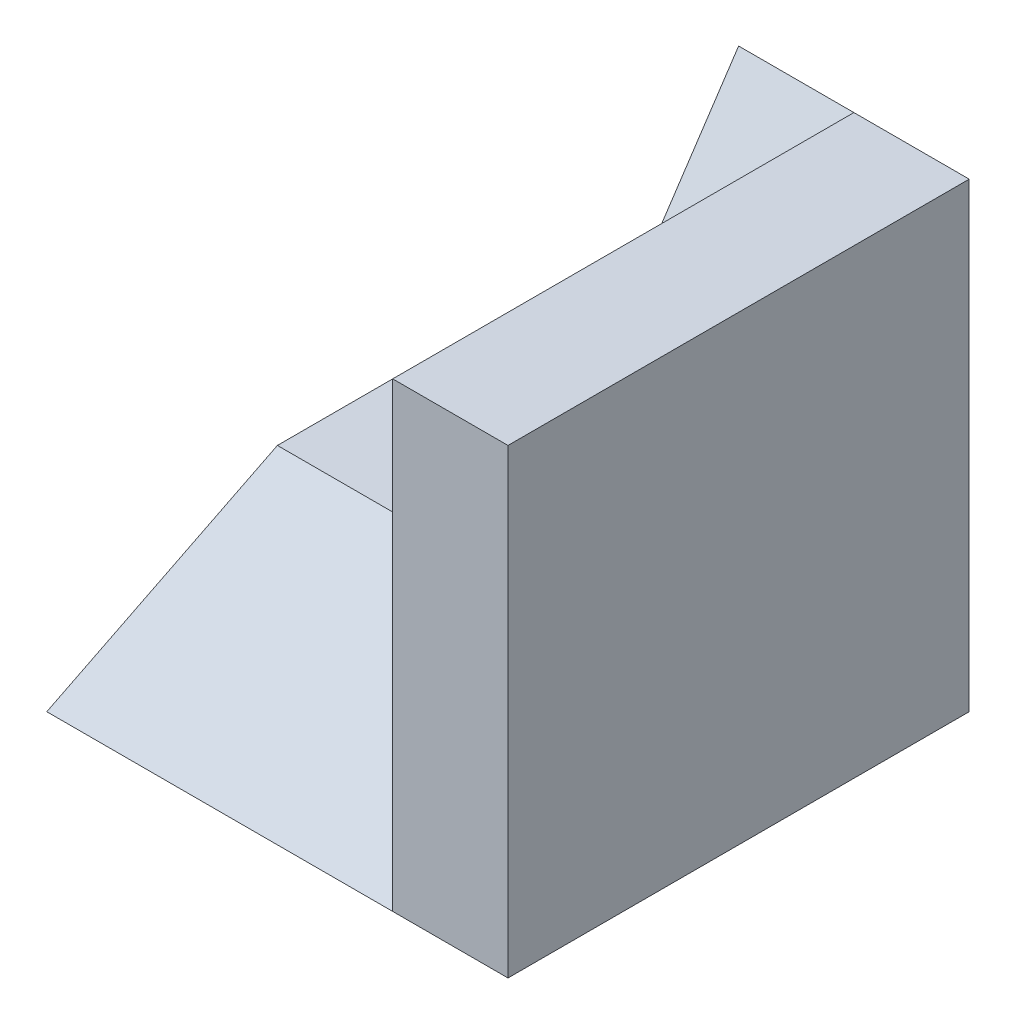
ISO-10303-21;
HEADER;
FILE_DESCRIPTION(('STEP AP214'),'2;1');
FILE_NAME('part.step','',(''),(''),'','','');
FILE_SCHEMA(('AUTOMOTIVE_DESIGN { 1 0 10303 214 1 1 1 1 }'));
ENDSEC;
DATA;
#1=APPLICATION_CONTEXT('core data for automotive mechanical design processes');
#2=APPLICATION_PROTOCOL_DEFINITION('international standard','automotive_design',2000,#1);
#3=PRODUCT_CONTEXT('',#1,'mechanical');
#4=PRODUCT('Part','Part','',(#3));
#5=PRODUCT_RELATED_PRODUCT_CATEGORY('part','',(#4));
#6=PRODUCT_DEFINITION_FORMATION('','',#4);
#7=PRODUCT_DEFINITION_CONTEXT('part definition',#1,'design');
#8=PRODUCT_DEFINITION('design','',#6,#7);
#9=PRODUCT_DEFINITION_SHAPE('','',#8);
#10=(LENGTH_UNIT() NAMED_UNIT(*) SI_UNIT(.MILLI.,.METRE.));
#11=(NAMED_UNIT(*) PLANE_ANGLE_UNIT() SI_UNIT($,.RADIAN.));
#12=(NAMED_UNIT(*) SI_UNIT($,.STERADIAN.) SOLID_ANGLE_UNIT());
#13=UNCERTAINTY_MEASURE_WITH_UNIT(LENGTH_MEASURE(1.E-05),#10,'distance_accuracy_value','');
#14=(GEOMETRIC_REPRESENTATION_CONTEXT(3) GLOBAL_UNCERTAINTY_ASSIGNED_CONTEXT((#13)) GLOBAL_UNIT_ASSIGNED_CONTEXT((#10,
#11,#12)) REPRESENTATION_CONTEXT('',''));
#15=CARTESIAN_POINT('',(0.,0.,0.));
#16=DIRECTION('',(0.,0.,1.));
#17=DIRECTION('',(1.,0.,0.));
#18=AXIS2_PLACEMENT_3D('',#15,#16,#17);
#19=CARTESIAN_POINT('',(-2.,4.,2.));
#20=DIRECTION('',(1.,0.,0.));
#21=DIRECTION('',(0.,0.,-1.));
#22=AXIS2_PLACEMENT_3D('',#19,#20,#21);
#23=PLANE('',#22);
#24=DIRECTION('',(0.,0.,1.));
#25=VECTOR('',#24,1.);
#26=CARTESIAN_POINT('',(-2.,1.,-2.));
#27=LINE('',#26,#25);
#28=CARTESIAN_POINT('',(-2.,1.,-2.));
#29=VERTEX_POINT('',#28);
#30=CARTESIAN_POINT('',(-2.,0.999999999999999,0.));
#31=VERTEX_POINT('',#30);
#32=EDGE_CURVE('E146',#29,#31,#27,.T.);
#33=ORIENTED_EDGE('',*,*,#32,.F.);
#34=DIRECTION('',(0.,-1.,0.));
#35=VECTOR('',#34,1.);
#36=CARTESIAN_POINT('',(-2.,4.,-2.));
#37=LINE('',#36,#35);
#38=CARTESIAN_POINT('',(-2.,0.,-2.));
#39=VERTEX_POINT('',#38);
#40=EDGE_CURVE('E93',#29,#39,#37,.T.);
#41=ORIENTED_EDGE('',*,*,#40,.T.);
#42=DIRECTION('',(0.,0.,1.));
#43=VECTOR('',#42,1.);
#44=CARTESIAN_POINT('',(-2.,0.,2.));
#45=LINE('',#44,#43);
#46=CARTESIAN_POINT('',(-2.,0.,2.));
#47=VERTEX_POINT('',#46);
#48=EDGE_CURVE('E86',#39,#47,#45,.T.);
#49=ORIENTED_EDGE('',*,*,#48,.T.);
#50=DIRECTION('',(0.,-0.447213595499958,0.894427190999916));
#51=VECTOR('',#50,1.);
#52=CARTESIAN_POINT('',(-2.,0.999999999999999,0.));
#53=LINE('',#52,#51);
#54=EDGE_CURVE('E68',#31,#47,#53,.T.);
#55=ORIENTED_EDGE('',*,*,#54,.F.);
#56=EDGE_LOOP('',(#33,#41,#49,#55));
#57=FACE_BOUND('',#56,.T.);
#58=ADVANCED_FACE('F33',(#57),#23,.F.);
#59=CARTESIAN_POINT('',(2.,4.,2.));
#60=DIRECTION('',(-1.,0.,0.));
#61=DIRECTION('',(0.,0.,1.));
#62=AXIS2_PLACEMENT_3D('',#59,#60,#61);
#63=PLANE('',#62);
#64=DIRECTION('',(0.,0.,-1.));
#65=VECTOR('',#64,1.);
#66=CARTESIAN_POINT('',(2.,0.,2.));
#67=LINE('',#66,#65);
#68=CARTESIAN_POINT('',(2.,0.,2.));
#69=VERTEX_POINT('',#68);
#70=CARTESIAN_POINT('',(2.,0.,-2.));
#71=VERTEX_POINT('',#70);
#72=EDGE_CURVE('E91',#69,#71,#67,.T.);
#73=ORIENTED_EDGE('',*,*,#72,.T.);
#74=DIRECTION('',(0.,-1.,0.));
#75=VECTOR('',#74,1.);
#76=CARTESIAN_POINT('',(2.,4.,-2.));
#77=LINE('',#76,#75);
#78=CARTESIAN_POINT('',(2.,4.,-2.));
#79=VERTEX_POINT('',#78);
#80=EDGE_CURVE('E42',#79,#71,#77,.T.);
#81=ORIENTED_EDGE('',*,*,#80,.F.);
#82=DIRECTION('',(0.,0.,-1.));
#83=VECTOR('',#82,1.);
#84=CARTESIAN_POINT('',(2.,4.,2.));
#85=LINE('',#84,#83);
#86=CARTESIAN_POINT('',(2.,4.,2.));
#87=VERTEX_POINT('',#86);
#88=EDGE_CURVE('E92',#87,#79,#85,.T.);
#89=ORIENTED_EDGE('',*,*,#88,.F.);
#90=DIRECTION('',(0.,-1.,0.));
#91=VECTOR('',#90,1.);
#92=CARTESIAN_POINT('',(2.,4.,2.));
#93=LINE('',#92,#91);
#94=EDGE_CURVE('E77',#87,#69,#93,.T.);
#95=ORIENTED_EDGE('',*,*,#94,.T.);
#96=EDGE_LOOP('',(#73,#81,#89,#95));
#97=FACE_BOUND('',#96,.T.);
#98=ADVANCED_FACE('F35',(#97),#63,.F.);
#99=CARTESIAN_POINT('',(-2.,4.,-2.));
#100=DIRECTION('',(0.,0.,1.));
#101=DIRECTION('',(1.,0.,0.));
#102=AXIS2_PLACEMENT_3D('',#99,#100,#101);
#103=PLANE('',#102);
#104=DIRECTION('',(-1.,0.,0.));
#105=VECTOR('',#104,1.);
#106=CARTESIAN_POINT('',(-2.,1.,-2.));
#107=LINE('',#106,#105);
#108=CARTESIAN_POINT('',(0.,1.,-2.));
#109=VERTEX_POINT('',#108);
#110=EDGE_CURVE('E137',#109,#29,#107,.T.);
#111=ORIENTED_EDGE('',*,*,#110,.F.);
#112=DIRECTION('',(0.,1.,0.));
#113=VECTOR('',#112,1.);
#114=CARTESIAN_POINT('',(0.,1.,-2.));
#115=LINE('',#114,#113);
#116=CARTESIAN_POINT('',(0.,4.,-2.));
#117=VERTEX_POINT('',#116);
#118=EDGE_CURVE('E126',#109,#117,#115,.T.);
#119=ORIENTED_EDGE('',*,*,#118,.T.);
#120=DIRECTION('',(-1.,0.,0.));
#121=VECTOR('',#120,1.);
#122=CARTESIAN_POINT('',(1.,4.,-2.));
#123=LINE('',#122,#121);
#124=CARTESIAN_POINT('',(1.,4.,-2.));
#125=VERTEX_POINT('',#124);
#126=EDGE_CURVE('E104',#125,#117,#123,.T.);
#127=ORIENTED_EDGE('',*,*,#126,.F.);
#128=DIRECTION('',(-1.,0.,0.));
#129=VECTOR('',#128,1.);
#130=CARTESIAN_POINT('',(-2.,4.,-2.));
#131=LINE('',#130,#129);
#132=EDGE_CURVE('E116',#79,#125,#131,.T.);
#133=ORIENTED_EDGE('',*,*,#132,.F.);
#134=ORIENTED_EDGE('',*,*,#80,.T.);
#135=DIRECTION('',(-1.,0.,0.));
#136=VECTOR('',#135,1.);
#137=CARTESIAN_POINT('',(-2.,0.,-2.));
#138=LINE('',#137,#136);
#139=EDGE_CURVE('E98',#71,#39,#138,.T.);
#140=ORIENTED_EDGE('',*,*,#139,.T.);
#141=ORIENTED_EDGE('',*,*,#40,.F.);
#142=EDGE_LOOP('',(#111,#119,#127,#133,#134,#140,#141));
#143=FACE_BOUND('',#142,.T.);
#144=ADVANCED_FACE('F112',(#143),#103,.F.);
#145=CARTESIAN_POINT('',(-2.,4.,2.));
#146=DIRECTION('',(0.,0.,-1.));
#147=DIRECTION('',(-1.,0.,0.));
#148=AXIS2_PLACEMENT_3D('',#145,#146,#147);
#149=PLANE('',#148);
#150=DIRECTION('',(1.,0.,0.));
#151=VECTOR('',#150,1.);
#152=CARTESIAN_POINT('',(-2.,4.,2.));
#153=LINE('',#152,#151);
#154=CARTESIAN_POINT('',(1.,4.,2.));
#155=VERTEX_POINT('',#154);
#156=EDGE_CURVE('E50',#155,#87,#153,.T.);
#157=ORIENTED_EDGE('',*,*,#156,.F.);
#158=DIRECTION('',(0.,1.,0.));
#159=VECTOR('',#158,1.);
#160=CARTESIAN_POINT('',(1.,0.,2.));
#161=LINE('',#160,#159);
#162=CARTESIAN_POINT('',(1.,0.,2.));
#163=VERTEX_POINT('',#162);
#164=EDGE_CURVE('E81',#163,#155,#161,.T.);
#165=ORIENTED_EDGE('',*,*,#164,.F.);
#166=DIRECTION('',(1.,0.,0.));
#167=VECTOR('',#166,1.);
#168=CARTESIAN_POINT('',(-2.,0.,2.));
#169=LINE('',#168,#167);
#170=EDGE_CURVE('E74',#163,#69,#169,.T.);
#171=ORIENTED_EDGE('',*,*,#170,.T.);
#172=ORIENTED_EDGE('',*,*,#94,.F.);
#173=EDGE_LOOP('',(#157,#165,#171,#172));
#174=FACE_BOUND('',#173,.T.);
#175=ADVANCED_FACE('F76',(#174),#149,.F.);
#176=CARTESIAN_POINT('',(0.,4.,0.));
#177=DIRECTION('',(0.,-1.,0.));
#178=DIRECTION('',(0.,0.,-1.));
#179=AXIS2_PLACEMENT_3D('',#176,#177,#178);
#180=PLANE('',#179);
#181=ORIENTED_EDGE('',*,*,#132,.T.);
#182=DIRECTION('',(0.,0.,-1.));
#183=VECTOR('',#182,1.);
#184=CARTESIAN_POINT('',(1.,4.,2.));
#185=LINE('',#184,#183);
#186=EDGE_CURVE('E125',#155,#125,#185,.T.);
#187=ORIENTED_EDGE('',*,*,#186,.F.);
#188=ORIENTED_EDGE('',*,*,#156,.T.);
#189=ORIENTED_EDGE('',*,*,#88,.T.);
#190=EDGE_LOOP('',(#181,#187,#188,#189));
#191=FACE_BOUND('',#190,.T.);
#192=ADVANCED_FACE('F120',(#191),#180,.F.);
#193=CARTESIAN_POINT('',(0.,0.,0.));
#194=DIRECTION('',(0.,-1.,0.));
#195=DIRECTION('',(0.,0.,-1.));
#196=AXIS2_PLACEMENT_3D('',#193,#194,#195);
#197=PLANE('',#196);
#198=ORIENTED_EDGE('',*,*,#72,.F.);
#199=ORIENTED_EDGE('',*,*,#170,.F.);
#200=EDGE_CURVE('E85',#47,#163,#169,.T.);
#201=ORIENTED_EDGE('',*,*,#200,.F.);
#202=ORIENTED_EDGE('',*,*,#48,.F.);
#203=ORIENTED_EDGE('',*,*,#139,.F.);
#204=EDGE_LOOP('',(#198,#199,#201,#202,#203));
#205=FACE_BOUND('',#204,.T.);
#206=ADVANCED_FACE('F95',(#205),#197,.T.);
#207=CARTESIAN_POINT('',(1.,0.999999999999999,0.));
#208=DIRECTION('',(0.,-0.894427190999916,-0.447213595499958));
#209=DIRECTION('',(0.,0.447213595499958,-0.894427190999916));
#210=AXIS2_PLACEMENT_3D('',#207,#208,#209);
#211=PLANE('',#210);
#212=ORIENTED_EDGE('',*,*,#54,.T.);
#213=ORIENTED_EDGE('',*,*,#200,.T.);
#214=DIRECTION('',(0.,-0.447213595499958,0.894427190999916));
#215=VECTOR('',#214,1.);
#216=CARTESIAN_POINT('',(1.,0.999999999999999,0.));
#217=LINE('',#216,#215);
#218=CARTESIAN_POINT('',(1.,0.999999999999999,0.));
#219=VERTEX_POINT('',#218);
#220=EDGE_CURVE('E128',#219,#163,#217,.T.);
#221=ORIENTED_EDGE('',*,*,#220,.F.);
#222=DIRECTION('',(-1.,0.,0.));
#223=VECTOR('',#222,1.);
#224=CARTESIAN_POINT('',(1.,0.999999999999999,0.));
#225=LINE('',#224,#223);
#226=CARTESIAN_POINT('',(0.,1.,0.));
#227=VERTEX_POINT('',#226);
#228=EDGE_CURVE('E100',#219,#227,#225,.T.);
#229=ORIENTED_EDGE('',*,*,#228,.T.);
#230=DIRECTION('',(1.,0.,0.));
#231=VECTOR('',#230,1.);
#232=CARTESIAN_POINT('',(-2.,1.,0.));
#233=LINE('',#232,#231);
#234=EDGE_CURVE('E143',#31,#227,#233,.T.);
#235=ORIENTED_EDGE('',*,*,#234,.F.);
#236=EDGE_LOOP('',(#212,#213,#221,#229,#235));
#237=FACE_BOUND('',#236,.T.);
#238=ADVANCED_FACE('F155',(#237),#211,.F.);
#239=CARTESIAN_POINT('',(1.,4.,-2.));
#240=DIRECTION('',(0.,-0.554700196225229,-0.832050294337843));
#241=DIRECTION('',(0.,0.832050294337844,-0.554700196225229));
#242=AXIS2_PLACEMENT_3D('',#239,#240,#241);
#243=PLANE('',#242);
#244=ORIENTED_EDGE('',*,*,#126,.T.);
#245=DIRECTION('',(0.,-0.832050294337844,0.554700196225229));
#246=VECTOR('',#245,1.);
#247=CARTESIAN_POINT('',(0.,4.,-2.));
#248=LINE('',#247,#246);
#249=EDGE_CURVE('E11',#117,#227,#248,.T.);
#250=ORIENTED_EDGE('',*,*,#249,.T.);
#251=ORIENTED_EDGE('',*,*,#228,.F.);
#252=DIRECTION('',(0.,-0.832050294337844,0.554700196225229));
#253=VECTOR('',#252,1.);
#254=CARTESIAN_POINT('',(1.,4.,-2.));
#255=LINE('',#254,#253);
#256=EDGE_CURVE('E131',#125,#219,#255,.T.);
#257=ORIENTED_EDGE('',*,*,#256,.F.);
#258=EDGE_LOOP('',(#244,#250,#251,#257));
#259=FACE_BOUND('',#258,.T.);
#260=ADVANCED_FACE('F165',(#259),#243,.F.);
#261=CARTESIAN_POINT('',(1.,0.,0.));
#262=DIRECTION('',(1.,0.,0.));
#263=DIRECTION('',(0.,0.,-1.));
#264=AXIS2_PLACEMENT_3D('',#261,#262,#263);
#265=PLANE('',#264);
#266=ORIENTED_EDGE('',*,*,#186,.T.);
#267=ORIENTED_EDGE('',*,*,#256,.T.);
#268=ORIENTED_EDGE('',*,*,#220,.T.);
#269=ORIENTED_EDGE('',*,*,#164,.T.);
#270=EDGE_LOOP('',(#266,#267,#268,#269));
#271=FACE_BOUND('',#270,.T.);
#272=ADVANCED_FACE('F161',(#271),#265,.F.);
#273=CARTESIAN_POINT('',(0.,1.,-2.));
#274=DIRECTION('',(1.,0.,0.));
#275=DIRECTION('',(0.,0.,-1.));
#276=AXIS2_PLACEMENT_3D('',#273,#274,#275);
#277=PLANE('',#276);
#278=ORIENTED_EDGE('',*,*,#118,.F.);
#279=DIRECTION('',(0.,0.,-1.));
#280=VECTOR('',#279,1.);
#281=CARTESIAN_POINT('',(0.,1.,-2.));
#282=LINE('',#281,#280);
#283=EDGE_CURVE('E140',#227,#109,#282,.T.);
#284=ORIENTED_EDGE('',*,*,#283,.F.);
#285=ORIENTED_EDGE('',*,*,#249,.F.);
#286=EDGE_LOOP('',(#278,#284,#285));
#287=FACE_BOUND('',#286,.T.);
#288=ADVANCED_FACE('F178',(#287),#277,.F.);
#289=CARTESIAN_POINT('',(0.,1.,0.));
#290=DIRECTION('',(0.,1.,0.));
#291=DIRECTION('',(0.,0.,1.));
#292=AXIS2_PLACEMENT_3D('',#289,#290,#291);
#293=PLANE('',#292);
#294=ORIENTED_EDGE('',*,*,#32,.T.);
#295=ORIENTED_EDGE('',*,*,#234,.T.);
#296=ORIENTED_EDGE('',*,*,#283,.T.);
#297=ORIENTED_EDGE('',*,*,#110,.T.);
#298=EDGE_LOOP('',(#294,#295,#296,#297));
#299=FACE_BOUND('',#298,.T.);
#300=ADVANCED_FACE('F151',(#299),#293,.T.);
#301=CLOSED_SHELL('',(#58,#98,#144,#175,#192,#206,#238,#260,#272,#288,#300));
#302=MANIFOLD_SOLID_BREP('B2',#301);
#303=ADVANCED_BREP_SHAPE_REPRESENTATION('',(#18,#302),#14);
#304=SHAPE_DEFINITION_REPRESENTATION(#9,#303);
ENDSEC;
END-ISO-10303-21;
